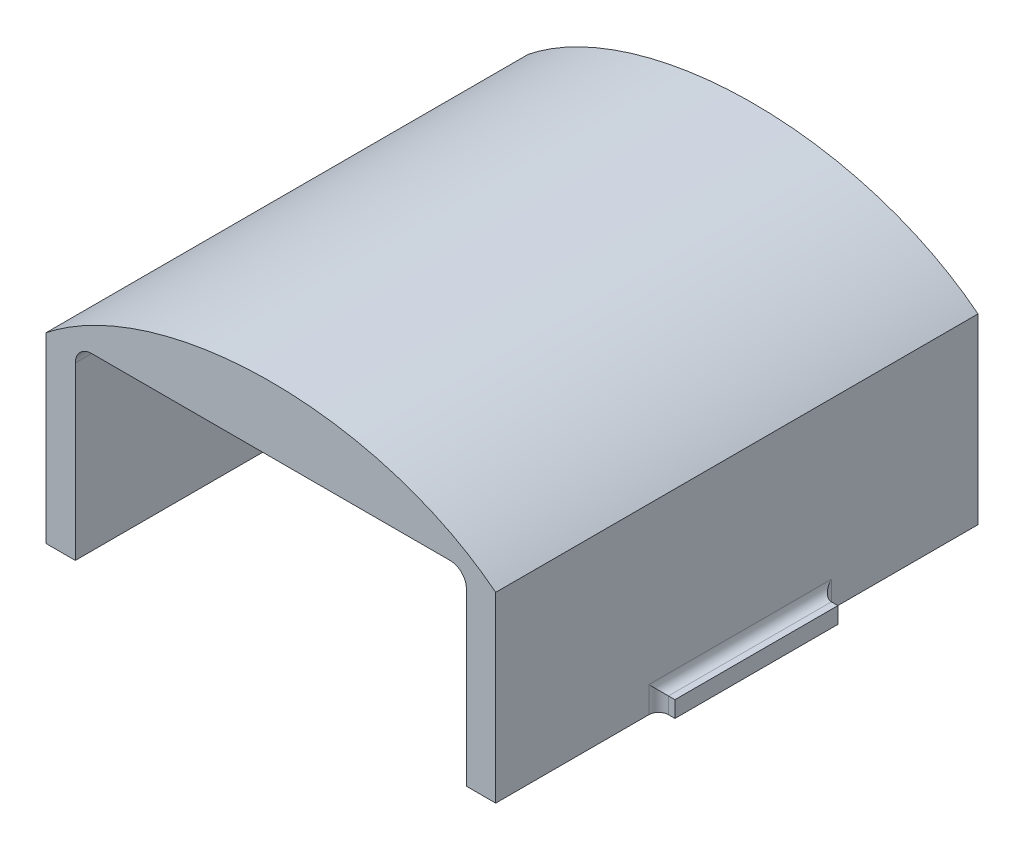
ISO-10303-21;
HEADER;
FILE_DESCRIPTION(('STEP AP214'),'2;1');
FILE_NAME('part.step','',(''),(''),'','','');
FILE_SCHEMA(('AUTOMOTIVE_DESIGN { 1 0 10303 214 1 1 1 1 }'));
ENDSEC;
DATA;
#1=APPLICATION_CONTEXT('core data for automotive mechanical design processes');
#2=APPLICATION_PROTOCOL_DEFINITION('international standard','automotive_design',2000,#1);
#3=PRODUCT_CONTEXT('',#1,'mechanical');
#4=PRODUCT('Part','Part','',(#3));
#5=PRODUCT_RELATED_PRODUCT_CATEGORY('part','',(#4));
#6=PRODUCT_DEFINITION_FORMATION('','',#4);
#7=PRODUCT_DEFINITION_CONTEXT('part definition',#1,'design');
#8=PRODUCT_DEFINITION('design','',#6,#7);
#9=PRODUCT_DEFINITION_SHAPE('','',#8);
#10=(LENGTH_UNIT() NAMED_UNIT(*) SI_UNIT(.MILLI.,.METRE.));
#11=(NAMED_UNIT(*) PLANE_ANGLE_UNIT() SI_UNIT($,.RADIAN.));
#12=(NAMED_UNIT(*) SI_UNIT($,.STERADIAN.) SOLID_ANGLE_UNIT());
#13=UNCERTAINTY_MEASURE_WITH_UNIT(LENGTH_MEASURE(1.E-05),#10,'distance_accuracy_value','');
#14=(GEOMETRIC_REPRESENTATION_CONTEXT(3) GLOBAL_UNCERTAINTY_ASSIGNED_CONTEXT((#13)) GLOBAL_UNIT_ASSIGNED_CONTEXT((#10,
#11,#12)) REPRESENTATION_CONTEXT('',''));
#15=CARTESIAN_POINT('',(0.,0.,0.));
#16=DIRECTION('',(0.,0.,1.));
#17=DIRECTION('',(1.,0.,0.));
#18=AXIS2_PLACEMENT_3D('',#15,#16,#17);
#19=CARTESIAN_POINT('',(-17.526,-17.3028487751792,-2.794));
#20=DIRECTION('',(-1.,0.,0.));
#21=DIRECTION('',(0.,0.,1.));
#22=AXIS2_PLACEMENT_3D('',#19,#20,#21);
#23=PLANE('',#22);
#24=DIRECTION('',(0.,0.,1.));
#25=VECTOR('',#24,1.);
#26=CARTESIAN_POINT('',(-17.526,-2.413,-15.494));
#27=LINE('',#26,#25);
#28=CARTESIAN_POINT('',(-17.526,-2.413,-28.956));
#29=VERTEX_POINT('',#28);
#30=CARTESIAN_POINT('',(-17.526,-2.413,-14.732));
#31=VERTEX_POINT('',#30);
#32=EDGE_CURVE('E424',#29,#31,#27,.T.);
#33=ORIENTED_EDGE('',*,*,#32,.T.);
#34=DIRECTION('',(0.,-1.,0.));
#35=VECTOR('',#34,1.);
#36=CARTESIAN_POINT('',(-17.526,-4.445,-14.732));
#37=LINE('',#36,#35);
#38=CARTESIAN_POINT('',(-17.526,-4.445,-14.732));
#39=VERTEX_POINT('',#38);
#40=EDGE_CURVE('E421',#31,#39,#37,.T.);
#41=ORIENTED_EDGE('',*,*,#40,.T.);
#42=DIRECTION('',(0.,0.,1.));
#43=VECTOR('',#42,1.);
#44=CARTESIAN_POINT('',(-17.526,-4.445,-40.386));
#45=LINE('',#44,#43);
#46=CARTESIAN_POINT('',(-17.526,-4.445,-2.794));
#47=VERTEX_POINT('',#46);
#48=EDGE_CURVE('E252',#39,#47,#45,.T.);
#49=ORIENTED_EDGE('',*,*,#48,.T.);
#50=DIRECTION('',(0.,1.,0.));
#51=VECTOR('',#50,1.);
#52=CARTESIAN_POINT('',(-17.526,-17.3028487751792,-2.794));
#53=LINE('',#52,#51);
#54=CARTESIAN_POINT('',(-17.526,9.78477102440319,-2.794));
#55=VERTEX_POINT('',#54);
#56=EDGE_CURVE('E264',#47,#55,#53,.T.);
#57=ORIENTED_EDGE('',*,*,#56,.T.);
#58=DIRECTION('',(0.,0.,1.));
#59=VECTOR('',#58,1.);
#60=CARTESIAN_POINT('',(-17.526,9.78477102440319,-25.5375451634622));
#61=LINE('',#60,#59);
#62=CARTESIAN_POINT('',(-17.526,9.78477102440319,-40.386));
#63=VERTEX_POINT('',#62);
#64=EDGE_CURVE('E427',#63,#55,#61,.T.);
#65=ORIENTED_EDGE('',*,*,#64,.F.);
#66=DIRECTION('',(0.,1.,0.));
#67=VECTOR('',#66,1.);
#68=CARTESIAN_POINT('',(-17.526,-17.3028487751792,-40.386));
#69=LINE('',#68,#67);
#70=CARTESIAN_POINT('',(-17.526,-4.445,-40.386));
#71=VERTEX_POINT('',#70);
#72=EDGE_CURVE('E265',#71,#63,#69,.T.);
#73=ORIENTED_EDGE('',*,*,#72,.F.);
#74=CARTESIAN_POINT('',(-17.526,-4.445,-28.956));
#75=VERTEX_POINT('',#74);
#76=EDGE_CURVE('E253',#71,#75,#45,.T.);
#77=ORIENTED_EDGE('',*,*,#76,.T.);
#78=DIRECTION('',(0.,1.,0.));
#79=VECTOR('',#78,1.);
#80=CARTESIAN_POINT('',(-17.526,-3.175,-28.956));
#81=LINE('',#80,#79);
#82=EDGE_CURVE('E426',#75,#29,#81,.T.);
#83=ORIENTED_EDGE('',*,*,#82,.T.);
#84=EDGE_LOOP('',(#33,#41,#49,#57,#65,#73,#77,#83));
#85=FACE_BOUND('',#84,.T.);
#86=ADVANCED_FACE('F39',(#85),#23,.T.);
#87=CARTESIAN_POINT('',(-15.24,-10.16,-40.64));
#88=DIRECTION('',(-1.,0.,0.));
#89=DIRECTION('',(0.,0.,1.));
#90=AXIS2_PLACEMENT_3D('',#87,#88,#89);
#91=PLANE('',#90);
#92=DIRECTION('',(0.,-1.,0.));
#93=VECTOR('',#92,1.);
#94=CARTESIAN_POINT('',(-15.24,-10.16,-40.386));
#95=LINE('',#94,#93);
#96=CARTESIAN_POINT('',(-15.24,8.89,-40.386));
#97=VERTEX_POINT('',#96);
#98=CARTESIAN_POINT('',(-15.24,-4.445,-40.386));
#99=VERTEX_POINT('',#98);
#100=EDGE_CURVE('E288',#97,#99,#95,.T.);
#101=ORIENTED_EDGE('',*,*,#100,.F.);
#102=DIRECTION('',(0.,0.,1.));
#103=VECTOR('',#102,1.);
#104=CARTESIAN_POINT('',(-15.24,8.89,-2.794));
#105=LINE('',#104,#103);
#106=CARTESIAN_POINT('',(-15.24,8.89,-2.794));
#107=VERTEX_POINT('',#106);
#108=EDGE_CURVE('E371',#97,#107,#105,.T.);
#109=ORIENTED_EDGE('',*,*,#108,.T.);
#110=DIRECTION('',(0.,1.,0.));
#111=VECTOR('',#110,1.);
#112=CARTESIAN_POINT('',(-15.24,-10.16,-2.794));
#113=LINE('',#112,#111);
#114=CARTESIAN_POINT('',(-15.24,-4.445,-2.794));
#115=VERTEX_POINT('',#114);
#116=EDGE_CURVE('E277',#115,#107,#113,.T.);
#117=ORIENTED_EDGE('',*,*,#116,.F.);
#118=DIRECTION('',(0.,0.,1.));
#119=VECTOR('',#118,1.);
#120=CARTESIAN_POINT('',(-15.24,-4.445,-40.64));
#121=LINE('',#120,#119);
#122=EDGE_CURVE('E262',#99,#115,#121,.T.);
#123=ORIENTED_EDGE('',*,*,#122,.F.);
#124=EDGE_LOOP('',(#101,#109,#117,#123));
#125=FACE_BOUND('',#124,.T.);
#126=ADVANCED_FACE('F305',(#125),#91,.F.);
#127=CARTESIAN_POINT('',(15.24,-10.16,-40.64));
#128=DIRECTION('',(1.,0.,0.));
#129=DIRECTION('',(0.,0.,-1.));
#130=AXIS2_PLACEMENT_3D('',#127,#128,#129);
#131=PLANE('',#130);
#132=DIRECTION('',(0.,-1.,0.));
#133=VECTOR('',#132,1.);
#134=CARTESIAN_POINT('',(15.24,-10.16,-2.794));
#135=LINE('',#134,#133);
#136=CARTESIAN_POINT('',(15.24,8.89,-2.794));
#137=VERTEX_POINT('',#136);
#138=CARTESIAN_POINT('',(15.24,-4.445,-2.794));
#139=VERTEX_POINT('',#138);
#140=EDGE_CURVE('E267',#137,#139,#135,.T.);
#141=ORIENTED_EDGE('',*,*,#140,.F.);
#142=DIRECTION('',(0.,0.,1.));
#143=VECTOR('',#142,1.);
#144=CARTESIAN_POINT('',(15.24,8.89,-40.386));
#145=LINE('',#144,#143);
#146=CARTESIAN_POINT('',(15.24,8.89,-40.386));
#147=VERTEX_POINT('',#146);
#148=EDGE_CURVE('E363',#137,#147,#145,.F.);
#149=ORIENTED_EDGE('',*,*,#148,.T.);
#150=DIRECTION('',(0.,1.,0.));
#151=VECTOR('',#150,1.);
#152=CARTESIAN_POINT('',(15.24,-10.16,-40.386));
#153=LINE('',#152,#151);
#154=CARTESIAN_POINT('',(15.24,-4.445,-40.386));
#155=VERTEX_POINT('',#154);
#156=EDGE_CURVE('E283',#155,#147,#153,.T.);
#157=ORIENTED_EDGE('',*,*,#156,.F.);
#158=DIRECTION('',(0.,0.,-1.));
#159=VECTOR('',#158,1.);
#160=CARTESIAN_POINT('',(15.24,-4.445,-40.64));
#161=LINE('',#160,#159);
#162=EDGE_CURVE('E260',#139,#155,#161,.T.);
#163=ORIENTED_EDGE('',*,*,#162,.F.);
#164=EDGE_LOOP('',(#141,#149,#157,#163));
#165=FACE_BOUND('',#164,.T.);
#166=ADVANCED_FACE('F343',(#165),#131,.F.);
#167=CARTESIAN_POINT('',(-17.526,-17.3028487751792,-40.386));
#168=DIRECTION('',(0.,0.,-1.));
#169=DIRECTION('',(-1.,0.,0.));
#170=AXIS2_PLACEMENT_3D('',#167,#168,#169);
#171=PLANE('',#170);
#172=DIRECTION('',(0.,1.,0.));
#173=VECTOR('',#172,1.);
#174=CARTESIAN_POINT('',(17.526,-17.3028487751792,-40.386));
#175=LINE('',#174,#173);
#176=CARTESIAN_POINT('',(17.526,-4.445,-40.386));
#177=VERTEX_POINT('',#176);
#178=CARTESIAN_POINT('',(17.526,9.78477102440317,-40.386));
#179=VERTEX_POINT('',#178);
#180=EDGE_CURVE('E268',#177,#179,#175,.T.);
#181=ORIENTED_EDGE('',*,*,#180,.F.);
#182=DIRECTION('',(-1.,0.,0.));
#183=VECTOR('',#182,1.);
#184=CARTESIAN_POINT('',(17.526,-4.445,-40.386));
#185=LINE('',#184,#183);
#186=EDGE_CURVE('E249',#177,#155,#185,.T.);
#187=ORIENTED_EDGE('',*,*,#186,.T.);
#188=ORIENTED_EDGE('',*,*,#156,.T.);
#189=CARTESIAN_POINT('',(13.97,8.89,-40.386));
#190=DIRECTION('',(0.,0.,-1.));
#191=DIRECTION('',(-1.,0.,0.));
#192=AXIS2_PLACEMENT_3D('',#189,#190,#191);
#193=CIRCLE('',#192,1.27);
#194=CARTESIAN_POINT('',(13.97,10.16,-40.386));
#195=VERTEX_POINT('',#194);
#196=EDGE_CURVE('E370',#147,#195,#193,.F.);
#197=ORIENTED_EDGE('',*,*,#196,.T.);
#198=DIRECTION('',(-1.,0.,0.));
#199=VECTOR('',#198,1.);
#200=CARTESIAN_POINT('',(15.24,10.16,-40.386));
#201=LINE('',#200,#199);
#202=CARTESIAN_POINT('',(-13.97,10.16,-40.386));
#203=VERTEX_POINT('',#202);
#204=EDGE_CURVE('E286',#195,#203,#201,.T.);
#205=ORIENTED_EDGE('',*,*,#204,.T.);
#206=CARTESIAN_POINT('',(-13.97,8.89,-40.386));
#207=DIRECTION('',(0.,0.,-1.));
#208=DIRECTION('',(-1.,0.,0.));
#209=AXIS2_PLACEMENT_3D('',#206,#207,#208);
#210=CIRCLE('',#209,1.27);
#211=EDGE_CURVE('E11',#203,#97,#210,.F.);
#212=ORIENTED_EDGE('',*,*,#211,.T.);
#213=ORIENTED_EDGE('',*,*,#100,.T.);
#214=EDGE_CURVE('E248',#99,#71,#185,.T.);
#215=ORIENTED_EDGE('',*,*,#214,.T.);
#216=ORIENTED_EDGE('',*,*,#72,.T.);
#217=CARTESIAN_POINT('',(0.,0.,-40.386));
#218=DIRECTION('',(0.,0.,1.));
#219=DIRECTION('',(-1.,0.,0.));
#220=AXIS2_PLACEMENT_3D('',#217,#218,#219);
#221=ELLIPSE('',#220,22.86,15.24);
#222=EDGE_CURVE('E290',#179,#63,#221,.T.);
#223=ORIENTED_EDGE('',*,*,#222,.F.);
#224=EDGE_LOOP('',(#181,#187,#188,#197,#205,#212,#213,#215,#216,#223));
#225=FACE_BOUND('',#224,.T.);
#226=ADVANCED_FACE('F353',(#225),#171,.T.);
#227=CARTESIAN_POINT('',(-17.526,-17.3028487751792,-2.794));
#228=DIRECTION('',(0.,0.,1.));
#229=DIRECTION('',(1.,0.,0.));
#230=AXIS2_PLACEMENT_3D('',#227,#228,#229);
#231=PLANE('',#230);
#232=ORIENTED_EDGE('',*,*,#56,.F.);
#233=DIRECTION('',(1.,0.,0.));
#234=VECTOR('',#233,1.);
#235=CARTESIAN_POINT('',(17.526,-4.445,-2.794));
#236=LINE('',#235,#234);
#237=EDGE_CURVE('E257',#47,#115,#236,.T.);
#238=ORIENTED_EDGE('',*,*,#237,.T.);
#239=ORIENTED_EDGE('',*,*,#116,.T.);
#240=CARTESIAN_POINT('',(-13.97,8.89,-2.794));
#241=DIRECTION('',(0.,0.,1.));
#242=DIRECTION('',(1.,0.,0.));
#243=AXIS2_PLACEMENT_3D('',#240,#241,#242);
#244=CIRCLE('',#243,1.27);
#245=CARTESIAN_POINT('',(-13.97,10.16,-2.794));
#246=VERTEX_POINT('',#245);
#247=EDGE_CURVE('E47',#107,#246,#244,.F.);
#248=ORIENTED_EDGE('',*,*,#247,.T.);
#249=DIRECTION('',(1.,0.,0.));
#250=VECTOR('',#249,1.);
#251=CARTESIAN_POINT('',(15.24,10.16,-2.794));
#252=LINE('',#251,#250);
#253=CARTESIAN_POINT('',(13.97,10.16,-2.794));
#254=VERTEX_POINT('',#253);
#255=EDGE_CURVE('E274',#246,#254,#252,.T.);
#256=ORIENTED_EDGE('',*,*,#255,.T.);
#257=CARTESIAN_POINT('',(13.97,8.89,-2.794));
#258=DIRECTION('',(0.,0.,1.));
#259=DIRECTION('',(1.,0.,0.));
#260=AXIS2_PLACEMENT_3D('',#257,#258,#259);
#261=CIRCLE('',#260,1.27);
#262=EDGE_CURVE('E368',#254,#137,#261,.F.);
#263=ORIENTED_EDGE('',*,*,#262,.T.);
#264=ORIENTED_EDGE('',*,*,#140,.T.);
#265=CARTESIAN_POINT('',(17.526,-4.445,-2.794));
#266=VERTEX_POINT('',#265);
#267=EDGE_CURVE('E256',#139,#266,#236,.T.);
#268=ORIENTED_EDGE('',*,*,#267,.T.);
#269=DIRECTION('',(0.,1.,0.));
#270=VECTOR('',#269,1.);
#271=CARTESIAN_POINT('',(17.526,-17.3028487751792,-2.794));
#272=LINE('',#271,#270);
#273=CARTESIAN_POINT('',(17.526,9.78477102440318,-2.794));
#274=VERTEX_POINT('',#273);
#275=EDGE_CURVE('E270',#266,#274,#272,.T.);
#276=ORIENTED_EDGE('',*,*,#275,.T.);
#277=CARTESIAN_POINT('',(0.,0.,-2.794));
#278=DIRECTION('',(0.,0.,1.));
#279=DIRECTION('',(-1.,0.,0.));
#280=AXIS2_PLACEMENT_3D('',#277,#278,#279);
#281=ELLIPSE('',#280,22.86,15.24);
#282=EDGE_CURVE('E280',#55,#274,#281,.F.);
#283=ORIENTED_EDGE('',*,*,#282,.F.);
#284=EDGE_LOOP('',(#232,#238,#239,#248,#256,#263,#264,#268,#276,#283));
#285=FACE_BOUND('',#284,.T.);
#286=ADVANCED_FACE('F347',(#285),#231,.T.);
#287=CARTESIAN_POINT('',(17.526,-17.3028487751792,-2.794));
#288=DIRECTION('',(1.,0.,0.));
#289=DIRECTION('',(0.,0.,-1.));
#290=AXIS2_PLACEMENT_3D('',#287,#288,#289);
#291=PLANE('',#290);
#292=DIRECTION('',(0.,0.,1.));
#293=VECTOR('',#292,1.);
#294=CARTESIAN_POINT('',(17.526,-2.413,-2.794));
#295=LINE('',#294,#293);
#296=CARTESIAN_POINT('',(17.526,-2.413,-14.732));
#297=VERTEX_POINT('',#296);
#298=CARTESIAN_POINT('',(17.526,-2.413,-28.956));
#299=VERTEX_POINT('',#298);
#300=EDGE_CURVE('E411',#297,#299,#295,.F.);
#301=ORIENTED_EDGE('',*,*,#300,.T.);
#302=DIRECTION('',(0.,1.,0.));
#303=VECTOR('',#302,1.);
#304=CARTESIAN_POINT('',(17.526,-17.3028487751792,-28.956));
#305=LINE('',#304,#303);
#306=CARTESIAN_POINT('',(17.526,-4.445,-28.956));
#307=VERTEX_POINT('',#306);
#308=EDGE_CURVE('E407',#299,#307,#305,.F.);
#309=ORIENTED_EDGE('',*,*,#308,.T.);
#310=DIRECTION('',(0.,0.,-1.));
#311=VECTOR('',#310,1.);
#312=CARTESIAN_POINT('',(17.526,-4.445,-40.386));
#313=LINE('',#312,#311);
#314=EDGE_CURVE('E244',#307,#177,#313,.T.);
#315=ORIENTED_EDGE('',*,*,#314,.T.);
#316=ORIENTED_EDGE('',*,*,#180,.T.);
#317=DIRECTION('',(0.,0.,1.));
#318=VECTOR('',#317,1.);
#319=CARTESIAN_POINT('',(17.526,9.78477102440317,-25.5375451634622));
#320=LINE('',#319,#318);
#321=EDGE_CURVE('E293',#274,#179,#320,.F.);
#322=ORIENTED_EDGE('',*,*,#321,.F.);
#323=ORIENTED_EDGE('',*,*,#275,.F.);
#324=CARTESIAN_POINT('',(17.526,-4.445,-14.732));
#325=VERTEX_POINT('',#324);
#326=EDGE_CURVE('E245',#266,#325,#313,.T.);
#327=ORIENTED_EDGE('',*,*,#326,.T.);
#328=DIRECTION('',(0.,-1.,0.));
#329=VECTOR('',#328,1.);
#330=CARTESIAN_POINT('',(17.526,-17.3028487751792,-14.732));
#331=LINE('',#330,#329);
#332=EDGE_CURVE('E409',#325,#297,#331,.F.);
#333=ORIENTED_EDGE('',*,*,#332,.T.);
#334=EDGE_LOOP('',(#301,#309,#315,#316,#322,#323,#327,#333));
#335=FACE_BOUND('',#334,.T.);
#336=ADVANCED_FACE('F350',(#335),#291,.T.);
#337=CARTESIAN_POINT('',(15.24,10.16,-40.64));
#338=DIRECTION('',(0.,1.,0.));
#339=DIRECTION('',(-1.,0.,0.));
#340=AXIS2_PLACEMENT_3D('',#337,#338,#339);
#341=PLANE('',#340);
#342=ORIENTED_EDGE('',*,*,#204,.F.);
#343=DIRECTION('',(0.,0.,1.));
#344=VECTOR('',#343,1.);
#345=CARTESIAN_POINT('',(13.97,10.16,-2.794));
#346=LINE('',#345,#344);
#347=EDGE_CURVE('E372',#195,#254,#346,.T.);
#348=ORIENTED_EDGE('',*,*,#347,.T.);
#349=ORIENTED_EDGE('',*,*,#255,.F.);
#350=DIRECTION('',(0.,0.,1.));
#351=VECTOR('',#350,1.);
#352=CARTESIAN_POINT('',(-13.97,10.16,-40.386));
#353=LINE('',#352,#351);
#354=EDGE_CURVE('E375',#246,#203,#353,.F.);
#355=ORIENTED_EDGE('',*,*,#354,.T.);
#356=EDGE_LOOP('',(#342,#348,#349,#355));
#357=FACE_BOUND('',#356,.T.);
#358=ADVANCED_FACE('F303',(#357),#341,.F.);
#359=CARTESIAN_POINT('',(0.,0.,-50.8));
#360=DIRECTION('',(0.,0.,1.));
#361=DIRECTION('',(-1.,0.,0.));
#362=AXIS2_PLACEMENT_3D('',#359,#360,#361);
#363=ELLIPSE('',#362,22.86,15.24);
#364=DIRECTION('',(0.,0.,1.));
#365=VECTOR('',#364,1.);
#366=SURFACE_OF_LINEAR_EXTRUSION('',#363,#365);
#367=ORIENTED_EDGE('',*,*,#222,.T.);
#368=ORIENTED_EDGE('',*,*,#64,.T.);
#369=ORIENTED_EDGE('',*,*,#282,.T.);
#370=ORIENTED_EDGE('',*,*,#321,.T.);
#371=EDGE_LOOP('',(#367,#368,#369,#370));
#372=FACE_BOUND('',#371,.T.);
#373=ADVANCED_FACE('F298',(#372),#366,.T.);
#374=CARTESIAN_POINT('',(0.,-4.445,0.));
#375=DIRECTION('',(0.,-1.,0.));
#376=DIRECTION('',(0.,0.,-1.));
#377=AXIS2_PLACEMENT_3D('',#374,#375,#376);
#378=PLANE('',#377);
#379=ORIENTED_EDGE('',*,*,#162,.T.);
#380=ORIENTED_EDGE('',*,*,#186,.F.);
#381=ORIENTED_EDGE('',*,*,#314,.F.);
#382=CARTESIAN_POINT('',(18.288,-4.445,-28.956));
#383=DIRECTION('',(0.,-1.,0.));
#384=DIRECTION('',(0.,0.,-1.));
#385=AXIS2_PLACEMENT_3D('',#382,#383,#384);
#386=CIRCLE('',#385,0.762);
#387=CARTESIAN_POINT('',(18.288,-4.445,-28.194));
#388=VERTEX_POINT('',#387);
#389=EDGE_CURVE('E385',#307,#388,#386,.F.);
#390=ORIENTED_EDGE('',*,*,#389,.T.);
#391=DIRECTION('',(-1.,0.,0.));
#392=VECTOR('',#391,1.);
#393=CARTESIAN_POINT('',(18.796,-4.445,-28.194));
#394=LINE('',#393,#392);
#395=CARTESIAN_POINT('',(18.796,-4.445,-28.194));
#396=VERTEX_POINT('',#395);
#397=EDGE_CURVE('E238',#396,#388,#394,.T.);
#398=ORIENTED_EDGE('',*,*,#397,.F.);
#399=DIRECTION('',(0.,0.,-1.));
#400=VECTOR('',#399,1.);
#401=CARTESIAN_POINT('',(18.796,-4.445,-15.494));
#402=LINE('',#401,#400);
#403=CARTESIAN_POINT('',(18.796,-4.445,-15.494));
#404=VERTEX_POINT('',#403);
#405=EDGE_CURVE('E226',#404,#396,#402,.T.);
#406=ORIENTED_EDGE('',*,*,#405,.F.);
#407=DIRECTION('',(-1.,0.,0.));
#408=VECTOR('',#407,1.);
#409=CARTESIAN_POINT('',(18.796,-4.445,-15.494));
#410=LINE('',#409,#408);
#411=CARTESIAN_POINT('',(18.288,-4.445,-15.494));
#412=VERTEX_POINT('',#411);
#413=EDGE_CURVE('E241',#404,#412,#410,.T.);
#414=ORIENTED_EDGE('',*,*,#413,.T.);
#415=CARTESIAN_POINT('',(18.288,-4.445,-14.732));
#416=DIRECTION('',(0.,-1.,0.));
#417=DIRECTION('',(0.,0.,-1.));
#418=AXIS2_PLACEMENT_3D('',#415,#416,#417);
#419=CIRCLE('',#418,0.762);
#420=EDGE_CURVE('E384',#412,#325,#419,.F.);
#421=ORIENTED_EDGE('',*,*,#420,.T.);
#422=ORIENTED_EDGE('',*,*,#326,.F.);
#423=ORIENTED_EDGE('',*,*,#267,.F.);
#424=EDGE_LOOP('',(#379,#380,#381,#390,#398,#406,#414,#421,#422,#423));
#425=FACE_BOUND('',#424,.T.);
#426=ADVANCED_FACE('F302',(#425),#378,.T.);
#427=ORIENTED_EDGE('',*,*,#122,.T.);
#428=ORIENTED_EDGE('',*,*,#237,.F.);
#429=ORIENTED_EDGE('',*,*,#48,.F.);
#430=CARTESIAN_POINT('',(-18.288,-4.445,-14.732));
#431=DIRECTION('',(0.,-1.,0.));
#432=DIRECTION('',(0.,0.,-1.));
#433=AXIS2_PLACEMENT_3D('',#430,#431,#432);
#434=CIRCLE('',#433,0.762);
#435=CARTESIAN_POINT('',(-18.288,-4.445,-15.494));
#436=VERTEX_POINT('',#435);
#437=EDGE_CURVE('E401',#39,#436,#434,.F.);
#438=ORIENTED_EDGE('',*,*,#437,.T.);
#439=DIRECTION('',(1.,0.,0.));
#440=VECTOR('',#439,1.);
#441=CARTESIAN_POINT('',(-18.796,-4.445,-15.494));
#442=LINE('',#441,#440);
#443=CARTESIAN_POINT('',(-18.796,-4.445,-15.494));
#444=VERTEX_POINT('',#443);
#445=EDGE_CURVE('E218',#444,#436,#442,.T.);
#446=ORIENTED_EDGE('',*,*,#445,.F.);
#447=DIRECTION('',(0.,0.,-1.));
#448=VECTOR('',#447,1.);
#449=CARTESIAN_POINT('',(-18.796,-4.445,-15.494));
#450=LINE('',#449,#448);
#451=CARTESIAN_POINT('',(-18.796,-4.445,-28.194));
#452=VERTEX_POINT('',#451);
#453=EDGE_CURVE('E208',#444,#452,#450,.T.);
#454=ORIENTED_EDGE('',*,*,#453,.T.);
#455=DIRECTION('',(1.,0.,0.));
#456=VECTOR('',#455,1.);
#457=CARTESIAN_POINT('',(-18.796,-4.445,-28.194));
#458=LINE('',#457,#456);
#459=CARTESIAN_POINT('',(-18.288,-4.445,-28.194));
#460=VERTEX_POINT('',#459);
#461=EDGE_CURVE('E220',#452,#460,#458,.T.);
#462=ORIENTED_EDGE('',*,*,#461,.T.);
#463=CARTESIAN_POINT('',(-18.288,-4.445,-28.956));
#464=DIRECTION('',(0.,-1.,0.));
#465=DIRECTION('',(0.,0.,-1.));
#466=AXIS2_PLACEMENT_3D('',#463,#464,#465);
#467=CIRCLE('',#466,0.762);
#468=EDGE_CURVE('E399',#460,#75,#467,.F.);
#469=ORIENTED_EDGE('',*,*,#468,.T.);
#470=ORIENTED_EDGE('',*,*,#76,.F.);
#471=ORIENTED_EDGE('',*,*,#214,.F.);
#472=EDGE_LOOP('',(#427,#428,#429,#438,#446,#454,#462,#469,#470,#471));
#473=FACE_BOUND('',#472,.T.);
#474=ADVANCED_FACE('F482',(#473),#378,.T.);
#475=CARTESIAN_POINT('',(18.796,-4.445,-15.494));
#476=DIRECTION('',(0.,0.,-1.));
#477=DIRECTION('',(-1.,0.,0.));
#478=AXIS2_PLACEMENT_3D('',#475,#476,#477);
#479=PLANE('',#478);
#480=DIRECTION('',(-1.,0.,0.));
#481=VECTOR('',#480,1.);
#482=CARTESIAN_POINT('',(18.796,-3.175,-15.494));
#483=LINE('',#482,#481);
#484=CARTESIAN_POINT('',(18.796,-3.175,-15.494));
#485=VERTEX_POINT('',#484);
#486=CARTESIAN_POINT('',(18.288,-3.175,-15.494));
#487=VERTEX_POINT('',#486);
#488=EDGE_CURVE('E232',#485,#487,#483,.T.);
#489=ORIENTED_EDGE('',*,*,#488,.T.);
#490=DIRECTION('',(0.,-1.,0.));
#491=VECTOR('',#490,1.);
#492=CARTESIAN_POINT('',(18.288,-4.445,-15.494));
#493=LINE('',#492,#491);
#494=EDGE_CURVE('E405',#487,#412,#493,.T.);
#495=ORIENTED_EDGE('',*,*,#494,.T.);
#496=ORIENTED_EDGE('',*,*,#413,.F.);
#497=DIRECTION('',(0.,-1.,0.));
#498=VECTOR('',#497,1.);
#499=CARTESIAN_POINT('',(18.796,-4.445,-15.494));
#500=LINE('',#499,#498);
#501=EDGE_CURVE('E198',#485,#404,#500,.T.);
#502=ORIENTED_EDGE('',*,*,#501,.F.);
#503=EDGE_LOOP('',(#489,#495,#496,#502));
#504=FACE_BOUND('',#503,.T.);
#505=ADVANCED_FACE('F467',(#504),#479,.F.);
#506=CARTESIAN_POINT('',(18.796,-4.445,-28.194));
#507=DIRECTION('',(0.,0.,1.));
#508=DIRECTION('',(1.,0.,0.));
#509=AXIS2_PLACEMENT_3D('',#506,#507,#508);
#510=PLANE('',#509);
#511=ORIENTED_EDGE('',*,*,#397,.T.);
#512=DIRECTION('',(0.,1.,0.));
#513=VECTOR('',#512,1.);
#514=CARTESIAN_POINT('',(18.288,-4.445,-28.194));
#515=LINE('',#514,#513);
#516=CARTESIAN_POINT('',(18.288,-3.175,-28.194));
#517=VERTEX_POINT('',#516);
#518=EDGE_CURVE('E413',#388,#517,#515,.T.);
#519=ORIENTED_EDGE('',*,*,#518,.T.);
#520=DIRECTION('',(-1.,0.,0.));
#521=VECTOR('',#520,1.);
#522=CARTESIAN_POINT('',(18.796,-3.175,-28.194));
#523=LINE('',#522,#521);
#524=CARTESIAN_POINT('',(18.796,-3.175,-28.194));
#525=VERTEX_POINT('',#524);
#526=EDGE_CURVE('E235',#525,#517,#523,.T.);
#527=ORIENTED_EDGE('',*,*,#526,.F.);
#528=DIRECTION('',(0.,1.,0.));
#529=VECTOR('',#528,1.);
#530=CARTESIAN_POINT('',(18.796,-4.445,-28.194));
#531=LINE('',#530,#529);
#532=EDGE_CURVE('E228',#396,#525,#531,.T.);
#533=ORIENTED_EDGE('',*,*,#532,.F.);
#534=EDGE_LOOP('',(#511,#519,#527,#533));
#535=FACE_BOUND('',#534,.T.);
#536=ADVANCED_FACE('F458',(#535),#510,.F.);
#537=CARTESIAN_POINT('',(18.796,-3.175,-15.494));
#538=DIRECTION('',(0.,-1.,0.));
#539=DIRECTION('',(0.,0.,-1.));
#540=AXIS2_PLACEMENT_3D('',#537,#538,#539);
#541=PLANE('',#540);
#542=ORIENTED_EDGE('',*,*,#526,.T.);
#543=DIRECTION('',(0.,0.,1.));
#544=VECTOR('',#543,1.);
#545=CARTESIAN_POINT('',(18.288,-3.175,-15.494));
#546=LINE('',#545,#544);
#547=EDGE_CURVE('E403',#517,#487,#546,.T.);
#548=ORIENTED_EDGE('',*,*,#547,.T.);
#549=ORIENTED_EDGE('',*,*,#488,.F.);
#550=DIRECTION('',(0.,0.,1.));
#551=VECTOR('',#550,1.);
#552=CARTESIAN_POINT('',(18.796,-3.175,-15.494));
#553=LINE('',#552,#551);
#554=EDGE_CURVE('E230',#525,#485,#553,.T.);
#555=ORIENTED_EDGE('',*,*,#554,.F.);
#556=EDGE_LOOP('',(#542,#548,#549,#555));
#557=FACE_BOUND('',#556,.T.);
#558=ADVANCED_FACE('F469',(#557),#541,.F.);
#559=CARTESIAN_POINT('',(18.796,0.,0.));
#560=DIRECTION('',(-1.,0.,0.));
#561=DIRECTION('',(0.,0.,1.));
#562=AXIS2_PLACEMENT_3D('',#559,#560,#561);
#563=PLANE('',#562);
#564=ORIENTED_EDGE('',*,*,#501,.T.);
#565=ORIENTED_EDGE('',*,*,#405,.T.);
#566=ORIENTED_EDGE('',*,*,#532,.T.);
#567=ORIENTED_EDGE('',*,*,#554,.T.);
#568=EDGE_LOOP('',(#564,#565,#566,#567));
#569=FACE_BOUND('',#568,.T.);
#570=ADVANCED_FACE('F462',(#569),#563,.F.);
#571=CARTESIAN_POINT('',(-18.796,-4.445,-15.494));
#572=DIRECTION('',(0.,0.,1.));
#573=DIRECTION('',(1.,0.,0.));
#574=AXIS2_PLACEMENT_3D('',#571,#572,#573);
#575=PLANE('',#574);
#576=ORIENTED_EDGE('',*,*,#445,.T.);
#577=DIRECTION('',(0.,-1.,0.));
#578=VECTOR('',#577,1.);
#579=CARTESIAN_POINT('',(-18.288,-3.175,-15.494));
#580=LINE('',#579,#578);
#581=CARTESIAN_POINT('',(-18.288,-3.175,-15.494));
#582=VERTEX_POINT('',#581);
#583=EDGE_CURVE('E194',#436,#582,#580,.F.);
#584=ORIENTED_EDGE('',*,*,#583,.T.);
#585=DIRECTION('',(1.,0.,0.));
#586=VECTOR('',#585,1.);
#587=CARTESIAN_POINT('',(-18.796,-3.175,-15.494));
#588=LINE('',#587,#586);
#589=CARTESIAN_POINT('',(-18.796,-3.175,-15.494));
#590=VERTEX_POINT('',#589);
#591=EDGE_CURVE('E187',#590,#582,#588,.T.);
#592=ORIENTED_EDGE('',*,*,#591,.F.);
#593=DIRECTION('',(0.,-1.,0.));
#594=VECTOR('',#593,1.);
#595=CARTESIAN_POINT('',(-18.796,-4.445,-15.494));
#596=LINE('',#595,#594);
#597=EDGE_CURVE('E191',#590,#444,#596,.T.);
#598=ORIENTED_EDGE('',*,*,#597,.T.);
#599=EDGE_LOOP('',(#576,#584,#592,#598));
#600=FACE_BOUND('',#599,.T.);
#601=ADVANCED_FACE('F190',(#600),#575,.T.);
#602=CARTESIAN_POINT('',(-18.796,-3.175,-15.494));
#603=DIRECTION('',(0.,1.,0.));
#604=DIRECTION('',(0.,0.,1.));
#605=AXIS2_PLACEMENT_3D('',#602,#603,#604);
#606=PLANE('',#605);
#607=ORIENTED_EDGE('',*,*,#591,.T.);
#608=DIRECTION('',(0.,0.,1.));
#609=VECTOR('',#608,1.);
#610=CARTESIAN_POINT('',(-18.288,-3.175,-28.194));
#611=LINE('',#610,#609);
#612=CARTESIAN_POINT('',(-18.288,-3.175,-28.194));
#613=VERTEX_POINT('',#612);
#614=EDGE_CURVE('E418',#582,#613,#611,.F.);
#615=ORIENTED_EDGE('',*,*,#614,.T.);
#616=DIRECTION('',(1.,0.,0.));
#617=VECTOR('',#616,1.);
#618=CARTESIAN_POINT('',(-18.796,-3.175,-28.194));
#619=LINE('',#618,#617);
#620=CARTESIAN_POINT('',(-18.796,-3.175,-28.194));
#621=VERTEX_POINT('',#620);
#622=EDGE_CURVE('E199',#621,#613,#619,.T.);
#623=ORIENTED_EDGE('',*,*,#622,.F.);
#624=DIRECTION('',(0.,0.,1.));
#625=VECTOR('',#624,1.);
#626=CARTESIAN_POINT('',(-18.796,-3.175,-15.494));
#627=LINE('',#626,#625);
#628=EDGE_CURVE('E205',#621,#590,#627,.T.);
#629=ORIENTED_EDGE('',*,*,#628,.T.);
#630=EDGE_LOOP('',(#607,#615,#623,#629));
#631=FACE_BOUND('',#630,.T.);
#632=ADVANCED_FACE('F211',(#631),#606,.T.);
#633=CARTESIAN_POINT('',(-18.796,-4.445,-28.194));
#634=DIRECTION('',(0.,0.,-1.));
#635=DIRECTION('',(-1.,0.,0.));
#636=AXIS2_PLACEMENT_3D('',#633,#634,#635);
#637=PLANE('',#636);
#638=ORIENTED_EDGE('',*,*,#622,.T.);
#639=DIRECTION('',(0.,1.,0.));
#640=VECTOR('',#639,1.);
#641=CARTESIAN_POINT('',(-18.288,-4.445,-28.194));
#642=LINE('',#641,#640);
#643=EDGE_CURVE('E416',#613,#460,#642,.F.);
#644=ORIENTED_EDGE('',*,*,#643,.T.);
#645=ORIENTED_EDGE('',*,*,#461,.F.);
#646=DIRECTION('',(0.,1.,0.));
#647=VECTOR('',#646,1.);
#648=CARTESIAN_POINT('',(-18.796,-4.445,-28.194));
#649=LINE('',#648,#647);
#650=EDGE_CURVE('E213',#452,#621,#649,.T.);
#651=ORIENTED_EDGE('',*,*,#650,.T.);
#652=EDGE_LOOP('',(#638,#644,#645,#651));
#653=FACE_BOUND('',#652,.T.);
#654=ADVANCED_FACE('F551',(#653),#637,.T.);
#655=CARTESIAN_POINT('',(-18.796,0.,0.));
#656=DIRECTION('',(1.,0.,0.));
#657=DIRECTION('',(0.,0.,1.));
#658=AXIS2_PLACEMENT_3D('',#655,#656,#657);
#659=PLANE('',#658);
#660=ORIENTED_EDGE('',*,*,#597,.F.);
#661=ORIENTED_EDGE('',*,*,#628,.F.);
#662=ORIENTED_EDGE('',*,*,#650,.F.);
#663=ORIENTED_EDGE('',*,*,#453,.F.);
#664=EDGE_LOOP('',(#660,#661,#662,#663));
#665=FACE_BOUND('',#664,.T.);
#666=ADVANCED_FACE('F203',(#665),#659,.F.);
#667=CARTESIAN_POINT('',(-18.288,-17.3028487751792,-28.956));
#668=DIRECTION('',(0.,-1.,0.));
#669=DIRECTION('',(0.,0.,-1.));
#670=AXIS2_PLACEMENT_3D('',#667,#668,#669);
#671=CYLINDRICAL_SURFACE('',#670,0.762);
#672=ORIENTED_EDGE('',*,*,#468,.F.);
#673=ORIENTED_EDGE('',*,*,#643,.F.);
#674=CARTESIAN_POINT('',(-18.288,-2.413,-28.956));
#675=DIRECTION('',(0.,-0.707106781186547,-0.707106781186547));
#676=DIRECTION('',(0.,-0.707106781186547,0.707106781186547));
#677=AXIS2_PLACEMENT_3D('',#674,#675,#676);
#678=ELLIPSE('',#677,1.0776307345283,0.762);
#679=EDGE_CURVE('E209',#29,#613,#678,.T.);
#680=ORIENTED_EDGE('',*,*,#679,.F.);
#681=ORIENTED_EDGE('',*,*,#82,.F.);
#682=EDGE_LOOP('',(#672,#673,#680,#681));
#683=FACE_BOUND('',#682,.T.);
#684=ADVANCED_FACE('F315',(#683),#671,.F.);
#685=CARTESIAN_POINT('',(-18.288,-2.413,-2.794));
#686=DIRECTION('',(0.,0.,-1.));
#687=DIRECTION('',(-1.,0.,0.));
#688=AXIS2_PLACEMENT_3D('',#685,#686,#687);
#689=CYLINDRICAL_SURFACE('',#688,0.762);
#690=ORIENTED_EDGE('',*,*,#679,.T.);
#691=ORIENTED_EDGE('',*,*,#614,.F.);
#692=CARTESIAN_POINT('',(-18.288,-2.413,-14.732));
#693=DIRECTION('',(0.,0.707106781186547,-0.707106781186547));
#694=DIRECTION('',(0.,-0.707106781186547,-0.707106781186547));
#695=AXIS2_PLACEMENT_3D('',#692,#693,#694);
#696=ELLIPSE('',#695,1.0776307345283,0.762);
#697=EDGE_CURVE('E391',#31,#582,#696,.T.);
#698=ORIENTED_EDGE('',*,*,#697,.F.);
#699=ORIENTED_EDGE('',*,*,#32,.F.);
#700=EDGE_LOOP('',(#690,#691,#698,#699));
#701=FACE_BOUND('',#700,.T.);
#702=ADVANCED_FACE('F311',(#701),#689,.F.);
#703=CARTESIAN_POINT('',(-18.288,-17.3028487751792,-14.732));
#704=DIRECTION('',(0.,1.,0.));
#705=DIRECTION('',(0.,0.,1.));
#706=AXIS2_PLACEMENT_3D('',#703,#704,#705);
#707=CYLINDRICAL_SURFACE('',#706,0.762);
#708=ORIENTED_EDGE('',*,*,#697,.T.);
#709=ORIENTED_EDGE('',*,*,#583,.F.);
#710=ORIENTED_EDGE('',*,*,#437,.F.);
#711=ORIENTED_EDGE('',*,*,#40,.F.);
#712=EDGE_LOOP('',(#708,#709,#710,#711));
#713=FACE_BOUND('',#712,.T.);
#714=ADVANCED_FACE('F307',(#713),#707,.F.);
#715=CARTESIAN_POINT('',(18.288,-4.445,-14.732));
#716=DIRECTION('',(0.,-1.,0.));
#717=DIRECTION('',(0.,0.,-1.));
#718=AXIS2_PLACEMENT_3D('',#715,#716,#717);
#719=CYLINDRICAL_SURFACE('',#718,0.762);
#720=ORIENTED_EDGE('',*,*,#420,.F.);
#721=ORIENTED_EDGE('',*,*,#494,.F.);
#722=CARTESIAN_POINT('',(18.288,-2.413,-14.732));
#723=DIRECTION('',(0.,-0.707106781186547,0.707106781186547));
#724=DIRECTION('',(0.,0.707106781186547,0.707106781186547));
#725=AXIS2_PLACEMENT_3D('',#722,#723,#724);
#726=ELLIPSE('',#725,1.0776307345283,0.762);
#727=EDGE_CURVE('E388',#297,#487,#726,.T.);
#728=ORIENTED_EDGE('',*,*,#727,.F.);
#729=ORIENTED_EDGE('',*,*,#332,.F.);
#730=EDGE_LOOP('',(#720,#721,#728,#729));
#731=FACE_BOUND('',#730,.T.);
#732=ADVANCED_FACE('F310',(#731),#719,.F.);
#733=CARTESIAN_POINT('',(18.288,-2.413,-15.494));
#734=DIRECTION('',(0.,0.,1.));
#735=DIRECTION('',(1.,0.,0.));
#736=AXIS2_PLACEMENT_3D('',#733,#734,#735);
#737=CYLINDRICAL_SURFACE('',#736,0.762);
#738=ORIENTED_EDGE('',*,*,#727,.T.);
#739=ORIENTED_EDGE('',*,*,#547,.F.);
#740=CARTESIAN_POINT('',(18.288,-2.413,-28.956));
#741=DIRECTION('',(0.,0.707106781186547,0.707106781186547));
#742=DIRECTION('',(0.,-0.707106781186547,0.707106781186547));
#743=AXIS2_PLACEMENT_3D('',#740,#741,#742);
#744=ELLIPSE('',#743,1.0776307345283,0.762);
#745=EDGE_CURVE('E392',#299,#517,#744,.T.);
#746=ORIENTED_EDGE('',*,*,#745,.F.);
#747=ORIENTED_EDGE('',*,*,#300,.F.);
#748=EDGE_LOOP('',(#738,#739,#746,#747));
#749=FACE_BOUND('',#748,.T.);
#750=ADVANCED_FACE('F324',(#749),#737,.F.);
#751=CARTESIAN_POINT('',(18.288,-4.445,-28.956));
#752=DIRECTION('',(0.,1.,0.));
#753=DIRECTION('',(0.,0.,1.));
#754=AXIS2_PLACEMENT_3D('',#751,#752,#753);
#755=CYLINDRICAL_SURFACE('',#754,0.762);
#756=ORIENTED_EDGE('',*,*,#389,.F.);
#757=ORIENTED_EDGE('',*,*,#308,.F.);
#758=ORIENTED_EDGE('',*,*,#745,.T.);
#759=ORIENTED_EDGE('',*,*,#518,.F.);
#760=EDGE_LOOP('',(#756,#757,#758,#759));
#761=FACE_BOUND('',#760,.T.);
#762=ADVANCED_FACE('F320',(#761),#755,.F.);
#763=CARTESIAN_POINT('',(13.97,8.89,-40.64));
#764=DIRECTION('',(0.,0.,-1.));
#765=DIRECTION('',(-1.,0.,0.));
#766=AXIS2_PLACEMENT_3D('',#763,#764,#765);
#767=CYLINDRICAL_SURFACE('',#766,1.27);
#768=ORIENTED_EDGE('',*,*,#196,.F.);
#769=ORIENTED_EDGE('',*,*,#148,.F.);
#770=ORIENTED_EDGE('',*,*,#262,.F.);
#771=ORIENTED_EDGE('',*,*,#347,.F.);
#772=EDGE_LOOP('',(#768,#769,#770,#771));
#773=FACE_BOUND('',#772,.T.);
#774=ADVANCED_FACE('F323',(#773),#767,.F.);
#775=CARTESIAN_POINT('',(-13.97,8.89,-40.64));
#776=DIRECTION('',(0.,0.,-1.));
#777=DIRECTION('',(-1.,0.,0.));
#778=AXIS2_PLACEMENT_3D('',#775,#776,#777);
#779=CYLINDRICAL_SURFACE('',#778,1.27);
#780=ORIENTED_EDGE('',*,*,#211,.F.);
#781=ORIENTED_EDGE('',*,*,#354,.F.);
#782=ORIENTED_EDGE('',*,*,#247,.F.);
#783=ORIENTED_EDGE('',*,*,#108,.F.);
#784=EDGE_LOOP('',(#780,#781,#782,#783));
#785=FACE_BOUND('',#784,.T.);
#786=ADVANCED_FACE('F41',(#785),#779,.F.);
#787=CLOSED_SHELL('',(#86,#126,#166,#226,#286,#336,#358,#373,#426,#474,#505,#536,#558,#570,#601,
#632,#654,#666,#684,#702,#714,#732,#750,#762,#774,#786));
#788=MANIFOLD_SOLID_BREP('B2',#787);
#789=ADVANCED_BREP_SHAPE_REPRESENTATION('',(#18,#788),#14);
#790=SHAPE_DEFINITION_REPRESENTATION(#9,#789);
ENDSEC;
END-ISO-10303-21;
